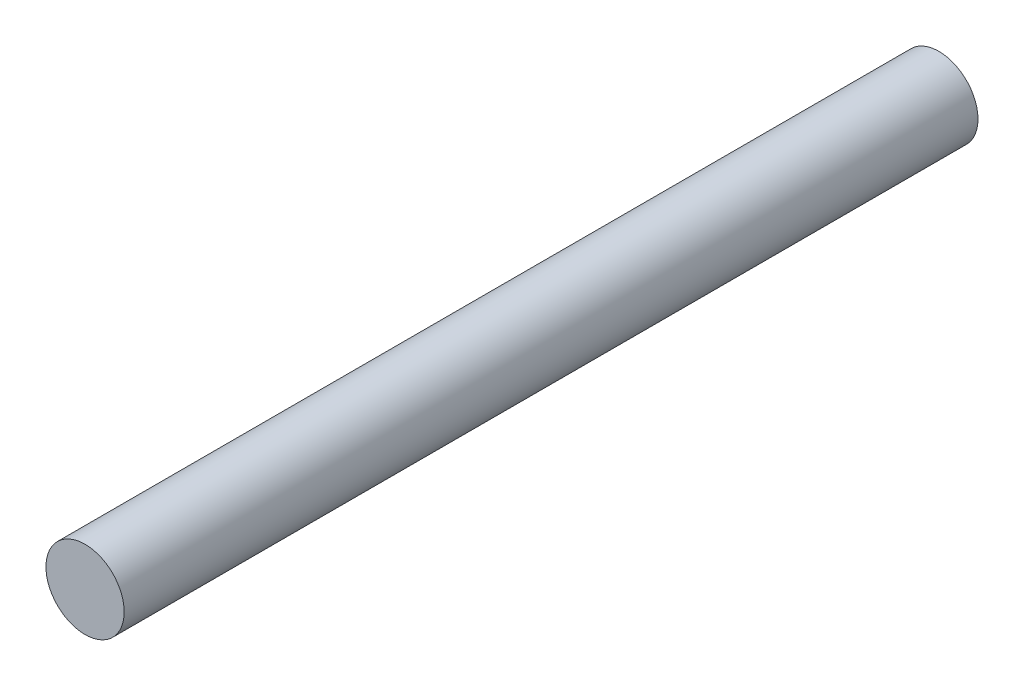
ISO-10303-21;
HEADER;
FILE_DESCRIPTION(('STEP AP214'),'2;1');
FILE_NAME('part.step','',(''),(''),'','','');
FILE_SCHEMA(('AUTOMOTIVE_DESIGN { 1 0 10303 214 1 1 1 1 }'));
ENDSEC;
DATA;
#1=APPLICATION_CONTEXT('core data for automotive mechanical design processes');
#2=APPLICATION_PROTOCOL_DEFINITION('international standard','automotive_design',2000,#1);
#3=PRODUCT_CONTEXT('',#1,'mechanical');
#4=PRODUCT('Part','Part','',(#3));
#5=PRODUCT_RELATED_PRODUCT_CATEGORY('part','',(#4));
#6=PRODUCT_DEFINITION_FORMATION('','',#4);
#7=PRODUCT_DEFINITION_CONTEXT('part definition',#1,'design');
#8=PRODUCT_DEFINITION('design','',#6,#7);
#9=PRODUCT_DEFINITION_SHAPE('','',#8);
#10=(LENGTH_UNIT() NAMED_UNIT(*) SI_UNIT(.MILLI.,.METRE.));
#11=(NAMED_UNIT(*) PLANE_ANGLE_UNIT() SI_UNIT($,.RADIAN.));
#12=(NAMED_UNIT(*) SI_UNIT($,.STERADIAN.) SOLID_ANGLE_UNIT());
#13=UNCERTAINTY_MEASURE_WITH_UNIT(LENGTH_MEASURE(1.E-05),#10,'distance_accuracy_value','');
#14=(GEOMETRIC_REPRESENTATION_CONTEXT(3) GLOBAL_UNCERTAINTY_ASSIGNED_CONTEXT((#13)) GLOBAL_UNIT_ASSIGNED_CONTEXT((#10,
#11,#12)) REPRESENTATION_CONTEXT('',''));
#15=CARTESIAN_POINT('',(0.,0.,0.));
#16=DIRECTION('',(0.,0.,1.));
#17=DIRECTION('',(1.,0.,0.));
#18=AXIS2_PLACEMENT_3D('',#15,#16,#17);
#19=CARTESIAN_POINT('',(0.,0.,36.));
#20=DIRECTION('',(0.,0.,-1.));
#21=DIRECTION('',(-1.,0.,0.));
#22=AXIS2_PLACEMENT_3D('',#19,#20,#21);
#23=CYLINDRICAL_SURFACE('',#22,1.65);
#24=CARTESIAN_POINT('',(0.,0.,36.));
#25=DIRECTION('',(0.,0.,1.));
#26=DIRECTION('',(1.,0.,0.));
#27=AXIS2_PLACEMENT_3D('',#24,#25,#26);
#28=CIRCLE('',#27,1.65);
#29=CARTESIAN_POINT('',(1.65,0.,36.));
#30=VERTEX_POINT('',#29);
#31=EDGE_CURVE('E10',#30,#30,#28,.T.);
#32=ORIENTED_EDGE('',*,*,#31,.F.);
#33=EDGE_LOOP('',(#32));
#34=FACE_BOUND('',#33,.T.);
#35=CARTESIAN_POINT('',(0.,0.,0.));
#36=DIRECTION('',(0.,0.,1.));
#37=DIRECTION('',(1.,0.,0.));
#38=AXIS2_PLACEMENT_3D('',#35,#36,#37);
#39=CIRCLE('',#38,1.65);
#40=CARTESIAN_POINT('',(1.65,0.,0.));
#41=VERTEX_POINT('',#40);
#42=EDGE_CURVE('E34',#41,#41,#39,.T.);
#43=ORIENTED_EDGE('',*,*,#42,.T.);
#44=EDGE_LOOP('',(#43));
#45=FACE_BOUND('',#44,.T.);
#46=ADVANCED_FACE('F31',(#34,#45),#23,.T.);
#47=CARTESIAN_POINT('',(0.,0.,36.));
#48=DIRECTION('',(0.,0.,1.));
#49=DIRECTION('',(1.,0.,0.));
#50=AXIS2_PLACEMENT_3D('',#47,#48,#49);
#51=PLANE('',#50);
#52=ORIENTED_EDGE('',*,*,#31,.T.);
#53=EDGE_LOOP('',(#52));
#54=FACE_BOUND('',#53,.T.);
#55=ADVANCED_FACE('F46',(#54),#51,.T.);
#56=CARTESIAN_POINT('',(0.,0.,0.));
#57=DIRECTION('',(0.,0.,1.));
#58=DIRECTION('',(1.,0.,0.));
#59=AXIS2_PLACEMENT_3D('',#56,#57,#58);
#60=PLANE('',#59);
#61=ORIENTED_EDGE('',*,*,#42,.F.);
#62=EDGE_LOOP('',(#61));
#63=FACE_BOUND('',#62,.T.);
#64=ADVANCED_FACE('F44',(#63),#60,.F.);
#65=CLOSED_SHELL('',(#46,#55,#64));
#66=MANIFOLD_SOLID_BREP('B2',#65);
#67=ADVANCED_BREP_SHAPE_REPRESENTATION('',(#18,#66),#14);
#68=SHAPE_DEFINITION_REPRESENTATION(#9,#67);
ENDSEC;
END-ISO-10303-21;
